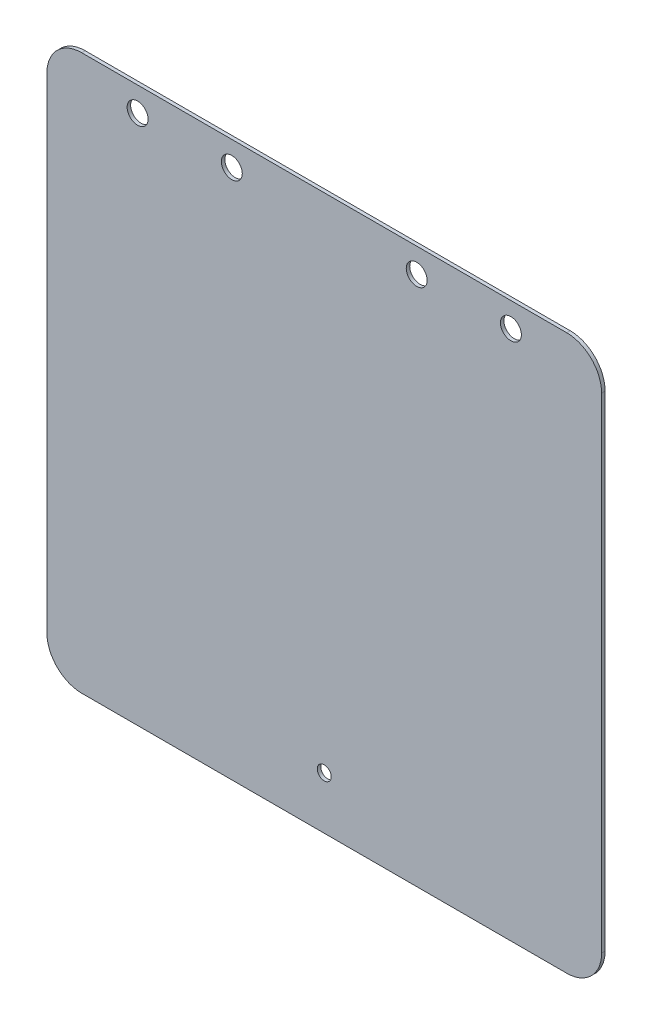
ISO-10303-21;
HEADER;
FILE_DESCRIPTION(('STEP AP214'),'2;1');
FILE_NAME('part.step','',(''),(''),'','','');
FILE_SCHEMA(('AUTOMOTIVE_DESIGN { 1 0 10303 214 1 1 1 1 }'));
ENDSEC;
DATA;
#1=APPLICATION_CONTEXT('core data for automotive mechanical design processes');
#2=APPLICATION_PROTOCOL_DEFINITION('international standard','automotive_design',2000,#1);
#3=PRODUCT_CONTEXT('',#1,'mechanical');
#4=PRODUCT('Part','Part','',(#3));
#5=PRODUCT_RELATED_PRODUCT_CATEGORY('part','',(#4));
#6=PRODUCT_DEFINITION_FORMATION('','',#4);
#7=PRODUCT_DEFINITION_CONTEXT('part definition',#1,'design');
#8=PRODUCT_DEFINITION('design','',#6,#7);
#9=PRODUCT_DEFINITION_SHAPE('','',#8);
#10=(LENGTH_UNIT() NAMED_UNIT(*) SI_UNIT(.MILLI.,.METRE.));
#11=(NAMED_UNIT(*) PLANE_ANGLE_UNIT() SI_UNIT($,.RADIAN.));
#12=(NAMED_UNIT(*) SI_UNIT($,.STERADIAN.) SOLID_ANGLE_UNIT());
#13=UNCERTAINTY_MEASURE_WITH_UNIT(LENGTH_MEASURE(1.E-05),#10,'distance_accuracy_value','');
#14=(GEOMETRIC_REPRESENTATION_CONTEXT(3) GLOBAL_UNCERTAINTY_ASSIGNED_CONTEXT((#13)) GLOBAL_UNIT_ASSIGNED_CONTEXT((#10,
#11,#12)) REPRESENTATION_CONTEXT('',''));
#15=CARTESIAN_POINT('',(0.,0.,0.));
#16=DIRECTION('',(0.,0.,1.));
#17=DIRECTION('',(1.,0.,0.));
#18=AXIS2_PLACEMENT_3D('',#15,#16,#17);
#19=CARTESIAN_POINT('',(69.5,69.5,1.));
#20=DIRECTION('',(0.,0.,-1.));
#21=DIRECTION('',(-1.,0.,0.));
#22=AXIS2_PLACEMENT_3D('',#19,#20,#21);
#23=PLANE('',#22);
#24=CARTESIAN_POINT('',(0.,-64.5,1.));
#25=DIRECTION('',(0.,0.,1.));
#26=DIRECTION('',(1.,0.,0.));
#27=AXIS2_PLACEMENT_3D('',#24,#25,#26);
#28=CIRCLE('',#27,2.);
#29=CARTESIAN_POINT('',(2.,-64.5,1.));
#30=VERTEX_POINT('',#29);
#31=EDGE_CURVE('E207',#30,#30,#28,.T.);
#32=ORIENTED_EDGE('',*,*,#31,.F.);
#33=EDGE_LOOP('',(#32));
#34=FACE_BOUND('',#33,.T.);
#35=CARTESIAN_POINT('',(-26.5,72.5,1.));
#36=DIRECTION('',(0.,0.,1.));
#37=DIRECTION('',(1.,0.,0.));
#38=AXIS2_PLACEMENT_3D('',#35,#36,#37);
#39=CIRCLE('',#38,3.);
#40=CARTESIAN_POINT('',(-23.5,72.5,1.));
#41=VERTEX_POINT('',#40);
#42=EDGE_CURVE('E199',#41,#41,#39,.T.);
#43=ORIENTED_EDGE('',*,*,#42,.F.);
#44=EDGE_LOOP('',(#43));
#45=FACE_BOUND('',#44,.T.);
#46=CARTESIAN_POINT('',(26.5,72.5,1.));
#47=DIRECTION('',(0.,0.,-1.));
#48=DIRECTION('',(-1.,0.,0.));
#49=AXIS2_PLACEMENT_3D('',#46,#47,#48);
#50=CIRCLE('',#49,3.);
#51=CARTESIAN_POINT('',(23.5,72.5,1.));
#52=VERTEX_POINT('',#51);
#53=EDGE_CURVE('E193',#52,#52,#50,.T.);
#54=ORIENTED_EDGE('',*,*,#53,.T.);
#55=EDGE_LOOP('',(#54));
#56=FACE_BOUND('',#55,.T.);
#57=CARTESIAN_POINT('',(53.5,72.5,1.));
#58=DIRECTION('',(0.,0.,-1.));
#59=DIRECTION('',(-1.,0.,0.));
#60=AXIS2_PLACEMENT_3D('',#57,#58,#59);
#61=CIRCLE('',#60,3.);
#62=CARTESIAN_POINT('',(50.5,72.5,1.));
#63=VERTEX_POINT('',#62);
#64=EDGE_CURVE('E186',#63,#63,#61,.T.);
#65=ORIENTED_EDGE('',*,*,#64,.T.);
#66=EDGE_LOOP('',(#65));
#67=FACE_BOUND('',#66,.T.);
#68=CARTESIAN_POINT('',(69.5,69.5,1.));
#69=DIRECTION('',(0.,0.,1.));
#70=DIRECTION('',(-1.,0.,0.));
#71=AXIS2_PLACEMENT_3D('',#68,#69,#70);
#72=CIRCLE('',#71,9.99999999999999);
#73=CARTESIAN_POINT('',(79.5,69.5,1.));
#74=VERTEX_POINT('',#73);
#75=CARTESIAN_POINT('',(69.5,79.5,1.));
#76=VERTEX_POINT('',#75);
#77=EDGE_CURVE('E149',#74,#76,#72,.T.);
#78=ORIENTED_EDGE('',*,*,#77,.T.);
#79=DIRECTION('',(-1.,0.,0.));
#80=VECTOR('',#79,1.);
#81=CARTESIAN_POINT('',(-69.5,79.5,1.));
#82=LINE('',#81,#80);
#83=CARTESIAN_POINT('',(-69.5,79.5,1.));
#84=VERTEX_POINT('',#83);
#85=EDGE_CURVE('E97',#76,#84,#82,.T.);
#86=ORIENTED_EDGE('',*,*,#85,.T.);
#87=CARTESIAN_POINT('',(-69.5,69.5,1.));
#88=DIRECTION('',(0.,0.,1.));
#89=DIRECTION('',(-1.,0.,0.));
#90=AXIS2_PLACEMENT_3D('',#87,#88,#89);
#91=CIRCLE('',#90,10.);
#92=CARTESIAN_POINT('',(-79.5,69.5,1.));
#93=VERTEX_POINT('',#92);
#94=EDGE_CURVE('E164',#84,#93,#91,.T.);
#95=ORIENTED_EDGE('',*,*,#94,.T.);
#96=DIRECTION('',(0.,-1.,0.));
#97=VECTOR('',#96,1.);
#98=CARTESIAN_POINT('',(-79.5,-69.5,1.));
#99=LINE('',#98,#97);
#100=CARTESIAN_POINT('',(-79.5,-69.5,1.));
#101=VERTEX_POINT('',#100);
#102=EDGE_CURVE('E177',#93,#101,#99,.T.);
#103=ORIENTED_EDGE('',*,*,#102,.T.);
#104=CARTESIAN_POINT('',(-69.5,-69.5,1.));
#105=DIRECTION('',(0.,0.,1.));
#106=DIRECTION('',(1.,0.,0.));
#107=AXIS2_PLACEMENT_3D('',#104,#105,#106);
#108=CIRCLE('',#107,10.);
#109=CARTESIAN_POINT('',(-69.5,-79.5,1.));
#110=VERTEX_POINT('',#109);
#111=EDGE_CURVE('E116',#101,#110,#108,.T.);
#112=ORIENTED_EDGE('',*,*,#111,.T.);
#113=DIRECTION('',(1.,0.,0.));
#114=VECTOR('',#113,1.);
#115=CARTESIAN_POINT('',(-69.5,-79.5,1.));
#116=LINE('',#115,#114);
#117=CARTESIAN_POINT('',(69.5,-79.5,1.));
#118=VERTEX_POINT('',#117);
#119=EDGE_CURVE('E110',#110,#118,#116,.T.);
#120=ORIENTED_EDGE('',*,*,#119,.T.);
#121=CARTESIAN_POINT('',(69.5,-69.5,1.));
#122=DIRECTION('',(0.,0.,1.));
#123=DIRECTION('',(-1.,0.,0.));
#124=AXIS2_PLACEMENT_3D('',#121,#122,#123);
#125=CIRCLE('',#124,9.99999999999999);
#126=CARTESIAN_POINT('',(79.5,-69.5,1.));
#127=VERTEX_POINT('',#126);
#128=EDGE_CURVE('E114',#118,#127,#125,.T.);
#129=ORIENTED_EDGE('',*,*,#128,.T.);
#130=DIRECTION('',(0.,1.,0.));
#131=VECTOR('',#130,1.);
#132=CARTESIAN_POINT('',(79.5,-69.5,1.));
#133=LINE('',#132,#131);
#134=EDGE_CURVE('E54',#127,#74,#133,.T.);
#135=ORIENTED_EDGE('',*,*,#134,.T.);
#136=EDGE_LOOP('',(#78,#86,#95,#103,#112,#120,#129,#135));
#137=FACE_BOUND('',#136,.T.);
#138=CARTESIAN_POINT('',(-53.5,72.5,1.));
#139=DIRECTION('',(0.,0.,1.));
#140=DIRECTION('',(1.,0.,0.));
#141=AXIS2_PLACEMENT_3D('',#138,#139,#140);
#142=CIRCLE('',#141,3.);
#143=CARTESIAN_POINT('',(-50.5,72.5,1.));
#144=VERTEX_POINT('',#143);
#145=EDGE_CURVE('E202',#144,#144,#142,.T.);
#146=ORIENTED_EDGE('',*,*,#145,.F.);
#147=EDGE_LOOP('',(#146));
#148=FACE_BOUND('',#147,.T.);
#149=ADVANCED_FACE('F37',(#34,#45,#56,#67,#137,#148),#23,.F.);
#150=CARTESIAN_POINT('',(69.5,69.5,0.));
#151=DIRECTION('',(0.,0.,-1.));
#152=DIRECTION('',(-1.,0.,0.));
#153=AXIS2_PLACEMENT_3D('',#150,#151,#152);
#154=PLANE('',#153);
#155=CARTESIAN_POINT('',(0.,-64.5,0.));
#156=DIRECTION('',(0.,0.,1.));
#157=DIRECTION('',(1.,0.,0.));
#158=AXIS2_PLACEMENT_3D('',#155,#156,#157);
#159=CIRCLE('',#158,2.);
#160=CARTESIAN_POINT('',(2.,-64.5,0.));
#161=VERTEX_POINT('',#160);
#162=EDGE_CURVE('E187',#161,#161,#159,.T.);
#163=ORIENTED_EDGE('',*,*,#162,.T.);
#164=EDGE_LOOP('',(#163));
#165=FACE_BOUND('',#164,.T.);
#166=CARTESIAN_POINT('',(26.5,72.5,0.));
#167=DIRECTION('',(0.,0.,-1.));
#168=DIRECTION('',(-1.,0.,0.));
#169=AXIS2_PLACEMENT_3D('',#166,#167,#168);
#170=CIRCLE('',#169,3.);
#171=CARTESIAN_POINT('',(23.5,72.5,0.));
#172=VERTEX_POINT('',#171);
#173=EDGE_CURVE('E190',#172,#172,#170,.T.);
#174=ORIENTED_EDGE('',*,*,#173,.F.);
#175=EDGE_LOOP('',(#174));
#176=FACE_BOUND('',#175,.T.);
#177=CARTESIAN_POINT('',(53.5,72.5,0.));
#178=DIRECTION('',(0.,0.,-1.));
#179=DIRECTION('',(-1.,0.,0.));
#180=AXIS2_PLACEMENT_3D('',#177,#178,#179);
#181=CIRCLE('',#180,3.);
#182=CARTESIAN_POINT('',(50.5,72.5,0.));
#183=VERTEX_POINT('',#182);
#184=EDGE_CURVE('E183',#183,#183,#181,.T.);
#185=ORIENTED_EDGE('',*,*,#184,.F.);
#186=EDGE_LOOP('',(#185));
#187=FACE_BOUND('',#186,.T.);
#188=CARTESIAN_POINT('',(69.5,69.5,0.));
#189=DIRECTION('',(0.,0.,1.));
#190=DIRECTION('',(-1.,0.,0.));
#191=AXIS2_PLACEMENT_3D('',#188,#189,#190);
#192=CIRCLE('',#191,9.99999999999999);
#193=CARTESIAN_POINT('',(79.5,69.5,0.));
#194=VERTEX_POINT('',#193);
#195=CARTESIAN_POINT('',(69.5,79.5,0.));
#196=VERTEX_POINT('',#195);
#197=EDGE_CURVE('E134',#194,#196,#192,.T.);
#198=ORIENTED_EDGE('',*,*,#197,.F.);
#199=DIRECTION('',(0.,1.,0.));
#200=VECTOR('',#199,1.);
#201=CARTESIAN_POINT('',(79.5,-69.5,0.));
#202=LINE('',#201,#200);
#203=CARTESIAN_POINT('',(79.5,-69.5,0.));
#204=VERTEX_POINT('',#203);
#205=EDGE_CURVE('E89',#204,#194,#202,.T.);
#206=ORIENTED_EDGE('',*,*,#205,.F.);
#207=CARTESIAN_POINT('',(69.5,-69.5,0.));
#208=DIRECTION('',(0.,0.,1.));
#209=DIRECTION('',(-1.,0.,0.));
#210=AXIS2_PLACEMENT_3D('',#207,#208,#209);
#211=CIRCLE('',#210,9.99999999999999);
#212=CARTESIAN_POINT('',(69.5,-79.5,0.));
#213=VERTEX_POINT('',#212);
#214=EDGE_CURVE('E83',#213,#204,#211,.T.);
#215=ORIENTED_EDGE('',*,*,#214,.F.);
#216=DIRECTION('',(1.,0.,0.));
#217=VECTOR('',#216,1.);
#218=CARTESIAN_POINT('',(-69.5,-79.5,0.));
#219=LINE('',#218,#217);
#220=CARTESIAN_POINT('',(-69.5,-79.5,0.));
#221=VERTEX_POINT('',#220);
#222=EDGE_CURVE('E124',#221,#213,#219,.T.);
#223=ORIENTED_EDGE('',*,*,#222,.F.);
#224=CARTESIAN_POINT('',(-69.5,-69.5,0.));
#225=DIRECTION('',(0.,0.,1.));
#226=DIRECTION('',(1.,0.,0.));
#227=AXIS2_PLACEMENT_3D('',#224,#225,#226);
#228=CIRCLE('',#227,10.);
#229=CARTESIAN_POINT('',(-79.5,-69.5,0.));
#230=VERTEX_POINT('',#229);
#231=EDGE_CURVE('E144',#230,#221,#228,.T.);
#232=ORIENTED_EDGE('',*,*,#231,.F.);
#233=DIRECTION('',(0.,-1.,0.));
#234=VECTOR('',#233,1.);
#235=CARTESIAN_POINT('',(-79.5,-69.5,0.));
#236=LINE('',#235,#234);
#237=CARTESIAN_POINT('',(-79.5,69.5,0.));
#238=VERTEX_POINT('',#237);
#239=EDGE_CURVE('E142',#238,#230,#236,.T.);
#240=ORIENTED_EDGE('',*,*,#239,.F.);
#241=CARTESIAN_POINT('',(-69.5,69.5,0.));
#242=DIRECTION('',(0.,0.,1.));
#243=DIRECTION('',(-1.,0.,0.));
#244=AXIS2_PLACEMENT_3D('',#241,#242,#243);
#245=CIRCLE('',#244,10.);
#246=CARTESIAN_POINT('',(-69.5,79.5,0.));
#247=VERTEX_POINT('',#246);
#248=EDGE_CURVE('E140',#247,#238,#245,.T.);
#249=ORIENTED_EDGE('',*,*,#248,.F.);
#250=DIRECTION('',(-1.,0.,0.));
#251=VECTOR('',#250,1.);
#252=CARTESIAN_POINT('',(-69.5,79.5,0.));
#253=LINE('',#252,#251);
#254=EDGE_CURVE('E137',#196,#247,#253,.T.);
#255=ORIENTED_EDGE('',*,*,#254,.F.);
#256=EDGE_LOOP('',(#198,#206,#215,#223,#232,#240,#249,#255));
#257=FACE_BOUND('',#256,.T.);
#258=CARTESIAN_POINT('',(-26.5,72.5,0.));
#259=DIRECTION('',(0.,0.,1.));
#260=DIRECTION('',(1.,0.,0.));
#261=AXIS2_PLACEMENT_3D('',#258,#259,#260);
#262=CIRCLE('',#261,3.);
#263=CARTESIAN_POINT('',(-23.5,72.5,0.));
#264=VERTEX_POINT('',#263);
#265=EDGE_CURVE('E196',#264,#264,#262,.T.);
#266=ORIENTED_EDGE('',*,*,#265,.T.);
#267=EDGE_LOOP('',(#266));
#268=FACE_BOUND('',#267,.T.);
#269=CARTESIAN_POINT('',(-53.5,72.5,0.));
#270=DIRECTION('',(0.,0.,1.));
#271=DIRECTION('',(1.,0.,0.));
#272=AXIS2_PLACEMENT_3D('',#269,#270,#271);
#273=CIRCLE('',#272,3.);
#274=CARTESIAN_POINT('',(-50.5,72.5,0.));
#275=VERTEX_POINT('',#274);
#276=EDGE_CURVE('E138',#275,#275,#273,.T.);
#277=ORIENTED_EDGE('',*,*,#276,.T.);
#278=EDGE_LOOP('',(#277));
#279=FACE_BOUND('',#278,.T.);
#280=ADVANCED_FACE('F168',(#165,#176,#187,#257,#268,#279),#154,.T.);
#281=CARTESIAN_POINT('',(69.5,69.5,1.));
#282=DIRECTION('',(0.,0.,-1.));
#283=DIRECTION('',(-1.,0.,0.));
#284=AXIS2_PLACEMENT_3D('',#281,#282,#283);
#285=CYLINDRICAL_SURFACE('',#284,9.99999999999999);
#286=ORIENTED_EDGE('',*,*,#197,.T.);
#287=DIRECTION('',(0.,0.,-1.));
#288=VECTOR('',#287,1.);
#289=CARTESIAN_POINT('',(69.5,79.5,1.));
#290=LINE('',#289,#288);
#291=EDGE_CURVE('E11',#76,#196,#290,.T.);
#292=ORIENTED_EDGE('',*,*,#291,.F.);
#293=ORIENTED_EDGE('',*,*,#77,.F.);
#294=DIRECTION('',(0.,0.,-1.));
#295=VECTOR('',#294,1.);
#296=CARTESIAN_POINT('',(79.5,69.5,1.));
#297=LINE('',#296,#295);
#298=EDGE_CURVE('E130',#74,#194,#297,.T.);
#299=ORIENTED_EDGE('',*,*,#298,.T.);
#300=EDGE_LOOP('',(#286,#292,#293,#299));
#301=FACE_BOUND('',#300,.T.);
#302=ADVANCED_FACE('F39',(#301),#285,.T.);
#303=CARTESIAN_POINT('',(-69.5,79.5,1.));
#304=DIRECTION('',(0.,-1.,0.));
#305=DIRECTION('',(0.,0.,-1.));
#306=AXIS2_PLACEMENT_3D('',#303,#304,#305);
#307=PLANE('',#306);
#308=ORIENTED_EDGE('',*,*,#254,.T.);
#309=DIRECTION('',(0.,0.,-1.));
#310=VECTOR('',#309,1.);
#311=CARTESIAN_POINT('',(-69.5,79.5,1.));
#312=LINE('',#311,#310);
#313=EDGE_CURVE('E46',#84,#247,#312,.T.);
#314=ORIENTED_EDGE('',*,*,#313,.F.);
#315=ORIENTED_EDGE('',*,*,#85,.F.);
#316=ORIENTED_EDGE('',*,*,#291,.T.);
#317=EDGE_LOOP('',(#308,#314,#315,#316));
#318=FACE_BOUND('',#317,.T.);
#319=ADVANCED_FACE('F258',(#318),#307,.F.);
#320=CARTESIAN_POINT('',(-69.5,69.5,1.));
#321=DIRECTION('',(0.,0.,-1.));
#322=DIRECTION('',(-1.,0.,0.));
#323=AXIS2_PLACEMENT_3D('',#320,#321,#322);
#324=CYLINDRICAL_SURFACE('',#323,10.);
#325=ORIENTED_EDGE('',*,*,#248,.T.);
#326=DIRECTION('',(0.,0.,-1.));
#327=VECTOR('',#326,1.);
#328=CARTESIAN_POINT('',(-79.5,69.5,1.));
#329=LINE('',#328,#327);
#330=EDGE_CURVE('E156',#93,#238,#329,.T.);
#331=ORIENTED_EDGE('',*,*,#330,.F.);
#332=ORIENTED_EDGE('',*,*,#94,.F.);
#333=ORIENTED_EDGE('',*,*,#313,.T.);
#334=EDGE_LOOP('',(#325,#331,#332,#333));
#335=FACE_BOUND('',#334,.T.);
#336=ADVANCED_FACE('F162',(#335),#324,.T.);
#337=CARTESIAN_POINT('',(-79.5,-69.5,1.));
#338=DIRECTION('',(1.,0.,0.));
#339=DIRECTION('',(0.,0.,-1.));
#340=AXIS2_PLACEMENT_3D('',#337,#338,#339);
#341=PLANE('',#340);
#342=ORIENTED_EDGE('',*,*,#239,.T.);
#343=DIRECTION('',(0.,0.,-1.));
#344=VECTOR('',#343,1.);
#345=CARTESIAN_POINT('',(-79.5,-69.5,1.));
#346=LINE('',#345,#344);
#347=EDGE_CURVE('E153',#101,#230,#346,.T.);
#348=ORIENTED_EDGE('',*,*,#347,.F.);
#349=ORIENTED_EDGE('',*,*,#102,.F.);
#350=ORIENTED_EDGE('',*,*,#330,.T.);
#351=EDGE_LOOP('',(#342,#348,#349,#350));
#352=FACE_BOUND('',#351,.T.);
#353=ADVANCED_FACE('F173',(#352),#341,.F.);
#354=CARTESIAN_POINT('',(-69.5,-69.5,1.));
#355=DIRECTION('',(0.,0.,-1.));
#356=DIRECTION('',(-1.,0.,0.));
#357=AXIS2_PLACEMENT_3D('',#354,#355,#356);
#358=CYLINDRICAL_SURFACE('',#357,10.);
#359=ORIENTED_EDGE('',*,*,#231,.T.);
#360=DIRECTION('',(0.,0.,-1.));
#361=VECTOR('',#360,1.);
#362=CARTESIAN_POINT('',(-69.5,-79.5,1.));
#363=LINE('',#362,#361);
#364=EDGE_CURVE('E125',#110,#221,#363,.T.);
#365=ORIENTED_EDGE('',*,*,#364,.F.);
#366=ORIENTED_EDGE('',*,*,#111,.F.);
#367=ORIENTED_EDGE('',*,*,#347,.T.);
#368=EDGE_LOOP('',(#359,#365,#366,#367));
#369=FACE_BOUND('',#368,.T.);
#370=ADVANCED_FACE('F176',(#369),#358,.T.);
#371=CARTESIAN_POINT('',(-69.5,-79.5,1.));
#372=DIRECTION('',(0.,1.,0.));
#373=DIRECTION('',(0.,0.,1.));
#374=AXIS2_PLACEMENT_3D('',#371,#372,#373);
#375=PLANE('',#374);
#376=ORIENTED_EDGE('',*,*,#222,.T.);
#377=DIRECTION('',(0.,0.,-1.));
#378=VECTOR('',#377,1.);
#379=CARTESIAN_POINT('',(69.5,-79.5,1.));
#380=LINE('',#379,#378);
#381=EDGE_CURVE('E121',#118,#213,#380,.T.);
#382=ORIENTED_EDGE('',*,*,#381,.F.);
#383=ORIENTED_EDGE('',*,*,#119,.F.);
#384=ORIENTED_EDGE('',*,*,#364,.T.);
#385=EDGE_LOOP('',(#376,#382,#383,#384));
#386=FACE_BOUND('',#385,.T.);
#387=ADVANCED_FACE('F122',(#386),#375,.F.);
#388=CARTESIAN_POINT('',(69.5,-69.5,1.));
#389=DIRECTION('',(0.,0.,-1.));
#390=DIRECTION('',(-1.,0.,0.));
#391=AXIS2_PLACEMENT_3D('',#388,#389,#390);
#392=CYLINDRICAL_SURFACE('',#391,9.99999999999999);
#393=ORIENTED_EDGE('',*,*,#214,.T.);
#394=DIRECTION('',(0.,0.,-1.));
#395=VECTOR('',#394,1.);
#396=CARTESIAN_POINT('',(79.5,-69.5,1.));
#397=LINE('',#396,#395);
#398=EDGE_CURVE('E126',#127,#204,#397,.T.);
#399=ORIENTED_EDGE('',*,*,#398,.F.);
#400=ORIENTED_EDGE('',*,*,#128,.F.);
#401=ORIENTED_EDGE('',*,*,#381,.T.);
#402=EDGE_LOOP('',(#393,#399,#400,#401));
#403=FACE_BOUND('',#402,.T.);
#404=ADVANCED_FACE('F128',(#403),#392,.T.);
#405=CARTESIAN_POINT('',(79.5,-69.5,1.));
#406=DIRECTION('',(-1.,0.,0.));
#407=DIRECTION('',(0.,-1.,0.));
#408=AXIS2_PLACEMENT_3D('',#405,#406,#407);
#409=PLANE('',#408);
#410=ORIENTED_EDGE('',*,*,#205,.T.);
#411=ORIENTED_EDGE('',*,*,#298,.F.);
#412=ORIENTED_EDGE('',*,*,#134,.F.);
#413=ORIENTED_EDGE('',*,*,#398,.T.);
#414=EDGE_LOOP('',(#410,#411,#412,#413));
#415=FACE_BOUND('',#414,.T.);
#416=ADVANCED_FACE('F234',(#415),#409,.F.);
#417=CARTESIAN_POINT('',(53.5,72.5,0.));
#418=DIRECTION('',(0.,0.,1.));
#419=DIRECTION('',(1.,0.,0.));
#420=AXIS2_PLACEMENT_3D('',#417,#418,#419);
#421=CYLINDRICAL_SURFACE('',#420,3.);
#422=ORIENTED_EDGE('',*,*,#184,.T.);
#423=EDGE_LOOP('',(#422));
#424=FACE_BOUND('',#423,.T.);
#425=ORIENTED_EDGE('',*,*,#64,.F.);
#426=EDGE_LOOP('',(#425));
#427=FACE_BOUND('',#426,.T.);
#428=ADVANCED_FACE('F231',(#424,#427),#421,.F.);
#429=CARTESIAN_POINT('',(26.5,72.5,0.));
#430=DIRECTION('',(0.,0.,1.));
#431=DIRECTION('',(1.,0.,0.));
#432=AXIS2_PLACEMENT_3D('',#429,#430,#431);
#433=CYLINDRICAL_SURFACE('',#432,3.);
#434=ORIENTED_EDGE('',*,*,#173,.T.);
#435=EDGE_LOOP('',(#434));
#436=FACE_BOUND('',#435,.T.);
#437=ORIENTED_EDGE('',*,*,#53,.F.);
#438=EDGE_LOOP('',(#437));
#439=FACE_BOUND('',#438,.T.);
#440=ADVANCED_FACE('F233',(#436,#439),#433,.F.);
#441=CARTESIAN_POINT('',(-26.5,72.5,0.));
#442=DIRECTION('',(0.,0.,1.));
#443=DIRECTION('',(1.,0.,0.));
#444=AXIS2_PLACEMENT_3D('',#441,#442,#443);
#445=CYLINDRICAL_SURFACE('',#444,3.);
#446=ORIENTED_EDGE('',*,*,#265,.F.);
#447=EDGE_LOOP('',(#446));
#448=FACE_BOUND('',#447,.T.);
#449=ORIENTED_EDGE('',*,*,#42,.T.);
#450=EDGE_LOOP('',(#449));
#451=FACE_BOUND('',#450,.T.);
#452=ADVANCED_FACE('F241',(#448,#451),#445,.F.);
#453=CARTESIAN_POINT('',(-53.5,72.5,0.));
#454=DIRECTION('',(0.,0.,1.));
#455=DIRECTION('',(1.,0.,0.));
#456=AXIS2_PLACEMENT_3D('',#453,#454,#455);
#457=CYLINDRICAL_SURFACE('',#456,3.);
#458=ORIENTED_EDGE('',*,*,#276,.F.);
#459=EDGE_LOOP('',(#458));
#460=FACE_BOUND('',#459,.T.);
#461=ORIENTED_EDGE('',*,*,#145,.T.);
#462=EDGE_LOOP('',(#461));
#463=FACE_BOUND('',#462,.T.);
#464=ADVANCED_FACE('F218',(#460,#463),#457,.F.);
#465=CARTESIAN_POINT('',(0.,-64.5,0.));
#466=DIRECTION('',(0.,0.,1.));
#467=DIRECTION('',(1.,0.,0.));
#468=AXIS2_PLACEMENT_3D('',#465,#466,#467);
#469=CYLINDRICAL_SURFACE('',#468,2.);
#470=ORIENTED_EDGE('',*,*,#162,.F.);
#471=EDGE_LOOP('',(#470));
#472=FACE_BOUND('',#471,.T.);
#473=ORIENTED_EDGE('',*,*,#31,.T.);
#474=EDGE_LOOP('',(#473));
#475=FACE_BOUND('',#474,.T.);
#476=ADVANCED_FACE('F215',(#472,#475),#469,.F.);
#477=CLOSED_SHELL('',(#149,#280,#302,#319,#336,#353,#370,#387,#404,#416,#428,#440,#452,#464,#476));
#478=MANIFOLD_SOLID_BREP('B2',#477);
#479=ADVANCED_BREP_SHAPE_REPRESENTATION('',(#18,#478),#14);
#480=SHAPE_DEFINITION_REPRESENTATION(#9,#479);
ENDSEC;
END-ISO-10303-21;
